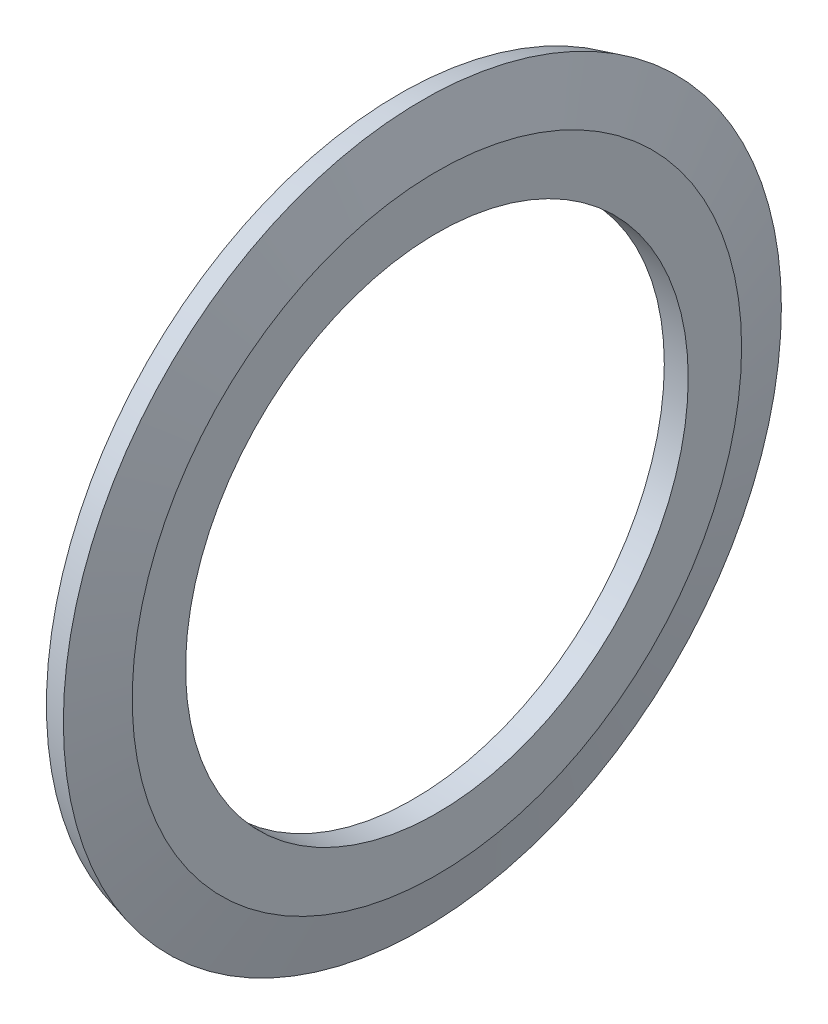
ISO-10303-21;
HEADER;
FILE_DESCRIPTION(('STEP AP214'),'2;1');
FILE_NAME('part.step','',(''),(''),'','','');
FILE_SCHEMA(('AUTOMOTIVE_DESIGN { 1 0 10303 214 1 1 1 1 }'));
ENDSEC;
DATA;
#1=APPLICATION_CONTEXT('core data for automotive mechanical design processes');
#2=APPLICATION_PROTOCOL_DEFINITION('international standard','automotive_design',2000,#1);
#3=PRODUCT_CONTEXT('',#1,'mechanical');
#4=PRODUCT('Part','Part','',(#3));
#5=PRODUCT_RELATED_PRODUCT_CATEGORY('part','',(#4));
#6=PRODUCT_DEFINITION_FORMATION('','',#4);
#7=PRODUCT_DEFINITION_CONTEXT('part definition',#1,'design');
#8=PRODUCT_DEFINITION('design','',#6,#7);
#9=PRODUCT_DEFINITION_SHAPE('','',#8);
#10=(LENGTH_UNIT() NAMED_UNIT(*) SI_UNIT(.MILLI.,.METRE.));
#11=(NAMED_UNIT(*) PLANE_ANGLE_UNIT() SI_UNIT($,.RADIAN.));
#12=(NAMED_UNIT(*) SI_UNIT($,.STERADIAN.) SOLID_ANGLE_UNIT());
#13=UNCERTAINTY_MEASURE_WITH_UNIT(LENGTH_MEASURE(1.E-05),#10,'distance_accuracy_value','');
#14=(GEOMETRIC_REPRESENTATION_CONTEXT(3) GLOBAL_UNCERTAINTY_ASSIGNED_CONTEXT((#13)) GLOBAL_UNIT_ASSIGNED_CONTEXT((#10,
#11,#12)) REPRESENTATION_CONTEXT('',''));
#15=CARTESIAN_POINT('',(0.,0.,0.));
#16=DIRECTION('',(0.,0.,1.));
#17=DIRECTION('',(1.,0.,0.));
#18=AXIS2_PLACEMENT_3D('',#15,#16,#17);
#19=CARTESIAN_POINT('',(0.999999999999999,10.5,0.));
#20=DIRECTION('',(1.,0.,0.));
#21=DIRECTION('',(0.,0.,-1.));
#22=AXIS2_PLACEMENT_3D('',#19,#20,#21);
#23=PLANE('',#22);
#24=CARTESIAN_POINT('',(0.999999999999999,0.,0.));
#25=DIRECTION('',(1.,0.,0.));
#26=DIRECTION('',(0.,0.,-1.));
#27=AXIS2_PLACEMENT_3D('',#24,#25,#26);
#28=CIRCLE('',#27,12.73);
#29=CARTESIAN_POINT('',(0.999999999999999,0.,-12.73));
#30=VERTEX_POINT('',#29);
#31=EDGE_CURVE('E10',#30,#30,#28,.T.);
#32=ORIENTED_EDGE('',*,*,#31,.T.);
#33=EDGE_LOOP('',(#32));
#34=FACE_BOUND('',#33,.T.);
#35=CARTESIAN_POINT('',(0.999999999999998,0.,0.));
#36=DIRECTION('',(1.,0.,0.));
#37=DIRECTION('',(0.,0.,-1.));
#38=AXIS2_PLACEMENT_3D('',#35,#36,#37);
#39=CIRCLE('',#38,10.5);
#40=CARTESIAN_POINT('',(0.999999999999998,0.,-10.5));
#41=VERTEX_POINT('',#40);
#42=EDGE_CURVE('E61',#41,#41,#39,.T.);
#43=ORIENTED_EDGE('',*,*,#42,.F.);
#44=EDGE_LOOP('',(#43));
#45=FACE_BOUND('',#44,.T.);
#46=ADVANCED_FACE('F33',(#34,#45),#23,.T.);
#47=CARTESIAN_POINT('',(0.999999999999999,0.,0.));
#48=DIRECTION('',(-1.,0.,0.));
#49=DIRECTION('',(0.,0.,1.));
#50=AXIS2_PLACEMENT_3D('',#47,#48,#49);
#51=CONICAL_SURFACE('',#50,12.73,1.30899693899575);
#52=CARTESIAN_POINT('',(0.391755333181347,0.,0.));
#53=DIRECTION('',(1.,0.,0.));
#54=DIRECTION('',(0.,0.,-1.));
#55=AXIS2_PLACEMENT_3D('',#52,#53,#54);
#56=CIRCLE('',#55,15.);
#57=CARTESIAN_POINT('',(0.391755333181347,0.,-15.));
#58=VERTEX_POINT('',#57);
#59=EDGE_CURVE('E40',#58,#58,#56,.T.);
#60=ORIENTED_EDGE('',*,*,#59,.T.);
#61=EDGE_LOOP('',(#60));
#62=FACE_BOUND('',#61,.T.);
#63=ORIENTED_EDGE('',*,*,#31,.F.);
#64=EDGE_LOOP('',(#63));
#65=FACE_BOUND('',#64,.T.);
#66=ADVANCED_FACE('F69',(#62,#65),#51,.T.);
#67=CARTESIAN_POINT('',(0.391755333181347,0.,0.));
#68=DIRECTION('',(1.,0.,0.));
#69=DIRECTION('',(0.,0.,-1.));
#70=AXIS2_PLACEMENT_3D('',#67,#68,#69);
#71=CONICAL_SURFACE('',#70,15.,0.261799387799151);
#72=CARTESIAN_POINT('',(-0.574170493107721,0.,0.));
#73=DIRECTION('',(1.,0.,0.));
#74=DIRECTION('',(0.,0.,-1.));
#75=AXIS2_PLACEMENT_3D('',#72,#73,#74);
#76=CIRCLE('',#75,14.7411809548975);
#77=CARTESIAN_POINT('',(-0.574170493107721,0.,-14.7411809548975));
#78=VERTEX_POINT('',#77);
#79=EDGE_CURVE('E46',#78,#78,#76,.T.);
#80=ORIENTED_EDGE('',*,*,#79,.T.);
#81=EDGE_LOOP('',(#80));
#82=FACE_BOUND('',#81,.T.);
#83=ORIENTED_EDGE('',*,*,#59,.F.);
#84=EDGE_LOOP('',(#83));
#85=FACE_BOUND('',#84,.T.);
#86=ADVANCED_FACE('F73',(#82,#85),#71,.T.);
#87=CARTESIAN_POINT('',(-0.574170493107721,0.,0.));
#88=DIRECTION('',(-1.,0.,0.));
#89=DIRECTION('',(0.,0.,1.));
#90=AXIS2_PLACEMENT_3D('',#87,#88,#89);
#91=CONICAL_SURFACE('',#90,14.7411809548975,1.30899693899575);
#92=CARTESIAN_POINT('',(0.,0.,0.));
#93=DIRECTION('',(1.,0.,0.));
#94=DIRECTION('',(0.,0.,-1.));
#95=AXIS2_PLACEMENT_3D('',#92,#93,#94);
#96=CIRCLE('',#95,12.5983475024126);
#97=CARTESIAN_POINT('',(0.,0.,-12.5983475024126));
#98=VERTEX_POINT('',#97);
#99=EDGE_CURVE('E51',#98,#98,#96,.T.);
#100=ORIENTED_EDGE('',*,*,#99,.T.);
#101=EDGE_LOOP('',(#100));
#102=FACE_BOUND('',#101,.T.);
#103=ORIENTED_EDGE('',*,*,#79,.F.);
#104=EDGE_LOOP('',(#103));
#105=FACE_BOUND('',#104,.T.);
#106=ADVANCED_FACE('F77',(#102,#105),#91,.F.);
#107=CARTESIAN_POINT('',(0.,10.5,0.));
#108=DIRECTION('',(-1.,0.,0.));
#109=DIRECTION('',(0.,0.,1.));
#110=AXIS2_PLACEMENT_3D('',#107,#108,#109);
#111=PLANE('',#110);
#112=CARTESIAN_POINT('',(0.,0.,0.));
#113=DIRECTION('',(1.,0.,0.));
#114=DIRECTION('',(0.,0.,-1.));
#115=AXIS2_PLACEMENT_3D('',#112,#113,#114);
#116=CIRCLE('',#115,10.5);
#117=CARTESIAN_POINT('',(0.,0.,-10.5));
#118=VERTEX_POINT('',#117);
#119=EDGE_CURVE('E57',#118,#118,#116,.T.);
#120=ORIENTED_EDGE('',*,*,#119,.T.);
#121=EDGE_LOOP('',(#120));
#122=FACE_BOUND('',#121,.T.);
#123=ORIENTED_EDGE('',*,*,#99,.F.);
#124=EDGE_LOOP('',(#123));
#125=FACE_BOUND('',#124,.T.);
#126=ADVANCED_FACE('F84',(#122,#125),#111,.T.);
#127=CARTESIAN_POINT('',(0.999999999999999,0.,0.));
#128=DIRECTION('',(1.,0.,0.));
#129=DIRECTION('',(0.,0.,-1.));
#130=AXIS2_PLACEMENT_3D('',#127,#128,#129);
#131=CYLINDRICAL_SURFACE('',#130,10.5);
#132=ORIENTED_EDGE('',*,*,#42,.T.);
#133=EDGE_LOOP('',(#132));
#134=FACE_BOUND('',#133,.T.);
#135=ORIENTED_EDGE('',*,*,#119,.F.);
#136=EDGE_LOOP('',(#135));
#137=FACE_BOUND('',#136,.T.);
#138=ADVANCED_FACE('F65',(#134,#137),#131,.F.);
#139=CLOSED_SHELL('',(#46,#66,#86,#106,#126,#138));
#140=MANIFOLD_SOLID_BREP('B2',#139);
#141=ADVANCED_BREP_SHAPE_REPRESENTATION('',(#18,#140),#14);
#142=SHAPE_DEFINITION_REPRESENTATION(#9,#141);
ENDSEC;
END-ISO-10303-21;
